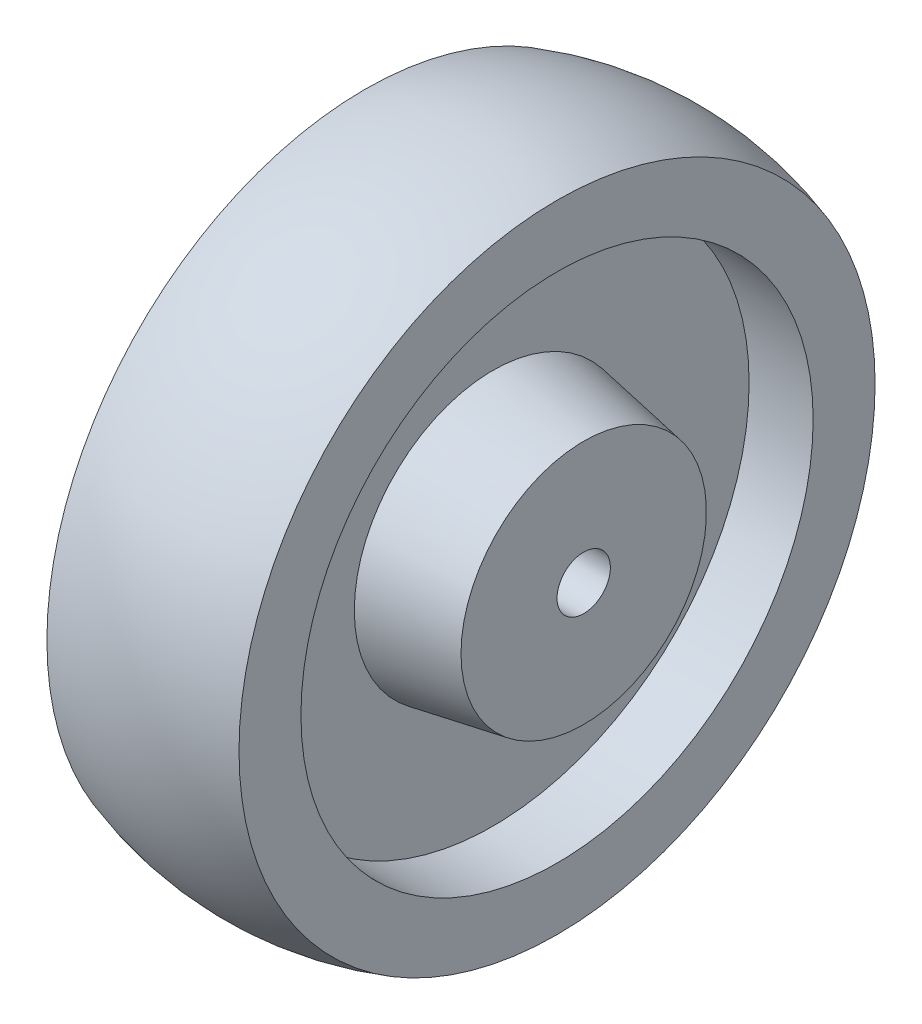
ISO-10303-21;
HEADER;
FILE_DESCRIPTION(('STEP AP214'),'2;1');
FILE_NAME('part.step','',(''),(''),'','','');
FILE_SCHEMA(('AUTOMOTIVE_DESIGN { 1 0 10303 214 1 1 1 1 }'));
ENDSEC;
DATA;
#1=APPLICATION_CONTEXT('core data for automotive mechanical design processes');
#2=APPLICATION_PROTOCOL_DEFINITION('international standard','automotive_design',2000,#1);
#3=PRODUCT_CONTEXT('',#1,'mechanical');
#4=PRODUCT('Part','Part','',(#3));
#5=PRODUCT_RELATED_PRODUCT_CATEGORY('part','',(#4));
#6=PRODUCT_DEFINITION_FORMATION('','',#4);
#7=PRODUCT_DEFINITION_CONTEXT('part definition',#1,'design');
#8=PRODUCT_DEFINITION('design','',#6,#7);
#9=PRODUCT_DEFINITION_SHAPE('','',#8);
#10=(LENGTH_UNIT() NAMED_UNIT(*) SI_UNIT(.MILLI.,.METRE.));
#11=(NAMED_UNIT(*) PLANE_ANGLE_UNIT() SI_UNIT($,.RADIAN.));
#12=(NAMED_UNIT(*) SI_UNIT($,.STERADIAN.) SOLID_ANGLE_UNIT());
#13=UNCERTAINTY_MEASURE_WITH_UNIT(LENGTH_MEASURE(1.E-05),#10,'distance_accuracy_value','');
#14=(GEOMETRIC_REPRESENTATION_CONTEXT(3) GLOBAL_UNCERTAINTY_ASSIGNED_CONTEXT((#13)) GLOBAL_UNIT_ASSIGNED_CONTEXT((#10,
#11,#12)) REPRESENTATION_CONTEXT('',''));
#15=CARTESIAN_POINT('',(0.,0.,0.));
#16=DIRECTION('',(0.,0.,1.));
#17=DIRECTION('',(1.,0.,0.));
#18=AXIS2_PLACEMENT_3D('',#15,#16,#17);
#19=CARTESIAN_POINT('',(23.,5.,0.));
#20=DIRECTION('',(-1.,0.,0.));
#21=DIRECTION('',(0.,0.,1.));
#22=AXIS2_PLACEMENT_3D('',#19,#20,#21);
#23=PLANE('',#22);
#24=CARTESIAN_POINT('',(23.,0.,0.));
#25=DIRECTION('',(-1.,0.,0.));
#26=DIRECTION('',(0.,0.,1.));
#27=AXIS2_PLACEMENT_3D('',#24,#25,#26);
#28=CIRCLE('',#27,23.);
#29=CARTESIAN_POINT('',(23.,0.,23.));
#30=VERTEX_POINT('',#29);
#31=EDGE_CURVE('E10',#30,#30,#28,.T.);
#32=ORIENTED_EDGE('',*,*,#31,.F.);
#33=EDGE_LOOP('',(#32));
#34=FACE_BOUND('',#33,.T.);
#35=CARTESIAN_POINT('',(23.,0.,0.));
#36=DIRECTION('',(-1.,0.,0.));
#37=DIRECTION('',(0.,0.,1.));
#38=AXIS2_PLACEMENT_3D('',#35,#36,#37);
#39=CIRCLE('',#38,5.);
#40=CARTESIAN_POINT('',(23.,0.,5.));
#41=VERTEX_POINT('',#40);
#42=EDGE_CURVE('E77',#41,#41,#39,.T.);
#43=ORIENTED_EDGE('',*,*,#42,.T.);
#44=EDGE_LOOP('',(#43));
#45=FACE_BOUND('',#44,.T.);
#46=ADVANCED_FACE('F37',(#34,#45),#23,.F.);
#47=CARTESIAN_POINT('',(23.,0.,0.));
#48=DIRECTION('',(-1.,0.,0.));
#49=DIRECTION('',(0.,0.,1.));
#50=AXIS2_PLACEMENT_3D('',#47,#48,#49);
#51=CONICAL_SURFACE('',#50,23.,0.17467219900824);
#52=CARTESIAN_POINT('',(6.,0.,0.));
#53=DIRECTION('',(-1.,0.,0.));
#54=DIRECTION('',(0.,0.,1.));
#55=AXIS2_PLACEMENT_3D('',#52,#53,#54);
#56=CIRCLE('',#55,26.);
#57=CARTESIAN_POINT('',(6.,0.,26.));
#58=VERTEX_POINT('',#57);
#59=EDGE_CURVE('E43',#58,#58,#56,.T.);
#60=ORIENTED_EDGE('',*,*,#59,.F.);
#61=EDGE_LOOP('',(#60));
#62=FACE_BOUND('',#61,.T.);
#63=ORIENTED_EDGE('',*,*,#31,.T.);
#64=EDGE_LOOP('',(#63));
#65=FACE_BOUND('',#64,.T.);
#66=ADVANCED_FACE('F138',(#62,#65),#51,.T.);
#67=CARTESIAN_POINT('',(6.,26.,0.));
#68=DIRECTION('',(-1.,0.,0.));
#69=DIRECTION('',(0.,0.,1.));
#70=AXIS2_PLACEMENT_3D('',#67,#68,#69);
#71=PLANE('',#70);
#72=CARTESIAN_POINT('',(6.,0.,0.));
#73=DIRECTION('',(-1.,0.,0.));
#74=DIRECTION('',(0.,0.,1.));
#75=AXIS2_PLACEMENT_3D('',#72,#73,#74);
#76=CIRCLE('',#75,48.);
#77=CARTESIAN_POINT('',(6.,0.,48.));
#78=VERTEX_POINT('',#77);
#79=EDGE_CURVE('E47',#78,#78,#76,.T.);
#80=ORIENTED_EDGE('',*,*,#79,.F.);
#81=EDGE_LOOP('',(#80));
#82=FACE_BOUND('',#81,.T.);
#83=ORIENTED_EDGE('',*,*,#59,.T.);
#84=EDGE_LOOP('',(#83));
#85=FACE_BOUND('',#84,.T.);
#86=ADVANCED_FACE('F133',(#82,#85),#71,.F.);
#87=CARTESIAN_POINT('',(0.,0.,0.));
#88=DIRECTION('',(-1.,0.,0.));
#89=DIRECTION('',(0.,0.,1.));
#90=AXIS2_PLACEMENT_3D('',#87,#88,#89);
#91=CYLINDRICAL_SURFACE('',#90,48.);
#92=CARTESIAN_POINT('',(18.,0.,0.));
#93=DIRECTION('',(-1.,0.,0.));
#94=DIRECTION('',(0.,0.,1.));
#95=AXIS2_PLACEMENT_3D('',#92,#93,#94);
#96=CIRCLE('',#95,48.);
#97=CARTESIAN_POINT('',(18.,0.,48.));
#98=VERTEX_POINT('',#97);
#99=EDGE_CURVE('E51',#98,#98,#96,.T.);
#100=ORIENTED_EDGE('',*,*,#99,.F.);
#101=EDGE_LOOP('',(#100));
#102=FACE_BOUND('',#101,.T.);
#103=ORIENTED_EDGE('',*,*,#79,.T.);
#104=EDGE_LOOP('',(#103));
#105=FACE_BOUND('',#104,.T.);
#106=ADVANCED_FACE('F127',(#102,#105),#91,.F.);
#107=CARTESIAN_POINT('',(18.,48.,0.));
#108=DIRECTION('',(-1.,0.,0.));
#109=DIRECTION('',(0.,0.,1.));
#110=AXIS2_PLACEMENT_3D('',#107,#108,#109);
#111=PLANE('',#110);
#112=CARTESIAN_POINT('',(18.,0.,0.));
#113=DIRECTION('',(-1.,0.,0.));
#114=DIRECTION('',(0.,0.,1.));
#115=AXIS2_PLACEMENT_3D('',#112,#113,#114);
#116=CIRCLE('',#115,59.6099807727489);
#117=CARTESIAN_POINT('',(18.,0.,59.6099807727489));
#118=VERTEX_POINT('',#117);
#119=EDGE_CURVE('E56',#118,#118,#116,.T.);
#120=ORIENTED_EDGE('',*,*,#119,.F.);
#121=EDGE_LOOP('',(#120));
#122=FACE_BOUND('',#121,.T.);
#123=ORIENTED_EDGE('',*,*,#99,.T.);
#124=EDGE_LOOP('',(#123));
#125=FACE_BOUND('',#124,.T.);
#126=ADVANCED_FACE('F121',(#122,#125),#111,.F.);
#127=CARTESIAN_POINT('',(0.,0.,0.));
#128=DIRECTION('',(-1.,0.,0.));
#129=DIRECTION('',(0.,0.,1.));
#130=AXIS2_PLACEMENT_3D('',#127,#128,#129);
#131=DEGENERATE_TOROIDAL_SURFACE('',#130,5.,57.5,.T.);
#132=CARTESIAN_POINT('',(-18.,0.,0.));
#133=DIRECTION('',(-1.,0.,0.));
#134=DIRECTION('',(0.,0.,1.));
#135=AXIS2_PLACEMENT_3D('',#132,#133,#134);
#136=CIRCLE('',#135,59.6099807727489);
#137=CARTESIAN_POINT('',(-18.,0.,59.6099807727489));
#138=VERTEX_POINT('',#137);
#139=EDGE_CURVE('E59',#138,#138,#136,.T.);
#140=ORIENTED_EDGE('',*,*,#139,.F.);
#141=EDGE_LOOP('',(#140));
#142=FACE_BOUND('',#141,.T.);
#143=ORIENTED_EDGE('',*,*,#119,.T.);
#144=EDGE_LOOP('',(#143));
#145=FACE_BOUND('',#144,.T.);
#146=ADVANCED_FACE('F115',(#142,#145),#131,.T.);
#147=CARTESIAN_POINT('',(-18.,48.,0.));
#148=DIRECTION('',(1.,0.,0.));
#149=DIRECTION('',(0.,0.,-1.));
#150=AXIS2_PLACEMENT_3D('',#147,#148,#149);
#151=PLANE('',#150);
#152=CARTESIAN_POINT('',(-18.,0.,0.));
#153=DIRECTION('',(-1.,0.,0.));
#154=DIRECTION('',(0.,0.,1.));
#155=AXIS2_PLACEMENT_3D('',#152,#153,#154);
#156=CIRCLE('',#155,48.);
#157=CARTESIAN_POINT('',(-18.,0.,48.));
#158=VERTEX_POINT('',#157);
#159=EDGE_CURVE('E62',#158,#158,#156,.T.);
#160=ORIENTED_EDGE('',*,*,#159,.F.);
#161=EDGE_LOOP('',(#160));
#162=FACE_BOUND('',#161,.T.);
#163=ORIENTED_EDGE('',*,*,#139,.T.);
#164=EDGE_LOOP('',(#163));
#165=FACE_BOUND('',#164,.T.);
#166=ADVANCED_FACE('F109',(#162,#165),#151,.F.);
#167=CARTESIAN_POINT('',(0.,0.,0.));
#168=DIRECTION('',(-1.,0.,0.));
#169=DIRECTION('',(0.,0.,1.));
#170=AXIS2_PLACEMENT_3D('',#167,#168,#169);
#171=CYLINDRICAL_SURFACE('',#170,48.);
#172=CARTESIAN_POINT('',(-6.,0.,0.));
#173=DIRECTION('',(-1.,0.,0.));
#174=DIRECTION('',(0.,0.,1.));
#175=AXIS2_PLACEMENT_3D('',#172,#173,#174);
#176=CIRCLE('',#175,48.);
#177=CARTESIAN_POINT('',(-6.,0.,48.));
#178=VERTEX_POINT('',#177);
#179=EDGE_CURVE('E65',#178,#178,#176,.T.);
#180=ORIENTED_EDGE('',*,*,#179,.F.);
#181=EDGE_LOOP('',(#180));
#182=FACE_BOUND('',#181,.T.);
#183=ORIENTED_EDGE('',*,*,#159,.T.);
#184=EDGE_LOOP('',(#183));
#185=FACE_BOUND('',#184,.T.);
#186=ADVANCED_FACE('F103',(#182,#185),#171,.F.);
#187=CARTESIAN_POINT('',(-6.,26.,0.));
#188=DIRECTION('',(1.,0.,0.));
#189=DIRECTION('',(0.,0.,-1.));
#190=AXIS2_PLACEMENT_3D('',#187,#188,#189);
#191=PLANE('',#190);
#192=CARTESIAN_POINT('',(-6.,0.,0.));
#193=DIRECTION('',(-1.,0.,0.));
#194=DIRECTION('',(0.,0.,1.));
#195=AXIS2_PLACEMENT_3D('',#192,#193,#194);
#196=CIRCLE('',#195,26.);
#197=CARTESIAN_POINT('',(-6.,0.,26.));
#198=VERTEX_POINT('',#197);
#199=EDGE_CURVE('E68',#198,#198,#196,.T.);
#200=ORIENTED_EDGE('',*,*,#199,.F.);
#201=EDGE_LOOP('',(#200));
#202=FACE_BOUND('',#201,.T.);
#203=ORIENTED_EDGE('',*,*,#179,.T.);
#204=EDGE_LOOP('',(#203));
#205=FACE_BOUND('',#204,.T.);
#206=ADVANCED_FACE('F97',(#202,#205),#191,.F.);
#207=CARTESIAN_POINT('',(-6.,0.,0.));
#208=DIRECTION('',(1.,0.,0.));
#209=DIRECTION('',(0.,0.,-1.));
#210=AXIS2_PLACEMENT_3D('',#207,#208,#209);
#211=CONICAL_SURFACE('',#210,26.,0.17467219900824);
#212=CARTESIAN_POINT('',(-23.,0.,0.));
#213=DIRECTION('',(-1.,0.,0.));
#214=DIRECTION('',(0.,0.,1.));
#215=AXIS2_PLACEMENT_3D('',#212,#213,#214);
#216=CIRCLE('',#215,23.);
#217=CARTESIAN_POINT('',(-23.,0.,23.));
#218=VERTEX_POINT('',#217);
#219=EDGE_CURVE('E71',#218,#218,#216,.T.);
#220=ORIENTED_EDGE('',*,*,#219,.F.);
#221=EDGE_LOOP('',(#220));
#222=FACE_BOUND('',#221,.T.);
#223=ORIENTED_EDGE('',*,*,#199,.T.);
#224=EDGE_LOOP('',(#223));
#225=FACE_BOUND('',#224,.T.);
#226=ADVANCED_FACE('F91',(#222,#225),#211,.T.);
#227=CARTESIAN_POINT('',(-23.,5.,0.));
#228=DIRECTION('',(1.,0.,0.));
#229=DIRECTION('',(0.,0.,-1.));
#230=AXIS2_PLACEMENT_3D('',#227,#228,#229);
#231=PLANE('',#230);
#232=CARTESIAN_POINT('',(-23.,0.,0.));
#233=DIRECTION('',(-1.,0.,0.));
#234=DIRECTION('',(0.,0.,1.));
#235=AXIS2_PLACEMENT_3D('',#232,#233,#234);
#236=CIRCLE('',#235,5.);
#237=CARTESIAN_POINT('',(-23.,0.,5.));
#238=VERTEX_POINT('',#237);
#239=EDGE_CURVE('E74',#238,#238,#236,.T.);
#240=ORIENTED_EDGE('',*,*,#239,.F.);
#241=EDGE_LOOP('',(#240));
#242=FACE_BOUND('',#241,.T.);
#243=ORIENTED_EDGE('',*,*,#219,.T.);
#244=EDGE_LOOP('',(#243));
#245=FACE_BOUND('',#244,.T.);
#246=ADVANCED_FACE('F85',(#242,#245),#231,.F.);
#247=CARTESIAN_POINT('',(0.,0.,0.));
#248=DIRECTION('',(-1.,0.,0.));
#249=DIRECTION('',(0.,0.,1.));
#250=AXIS2_PLACEMENT_3D('',#247,#248,#249);
#251=CYLINDRICAL_SURFACE('',#250,5.);
#252=ORIENTED_EDGE('',*,*,#42,.F.);
#253=EDGE_LOOP('',(#252));
#254=FACE_BOUND('',#253,.T.);
#255=ORIENTED_EDGE('',*,*,#239,.T.);
#256=EDGE_LOOP('',(#255));
#257=FACE_BOUND('',#256,.T.);
#258=ADVANCED_FACE('F82',(#254,#257),#251,.F.);
#259=CLOSED_SHELL('',(#46,#66,#86,#106,#126,#146,#166,#186,#206,#226,#246,#258));
#260=MANIFOLD_SOLID_BREP('B2',#259);
#261=ADVANCED_BREP_SHAPE_REPRESENTATION('',(#18,#260),#14);
#262=SHAPE_DEFINITION_REPRESENTATION(#9,#261);
ENDSEC;
END-ISO-10303-21;
